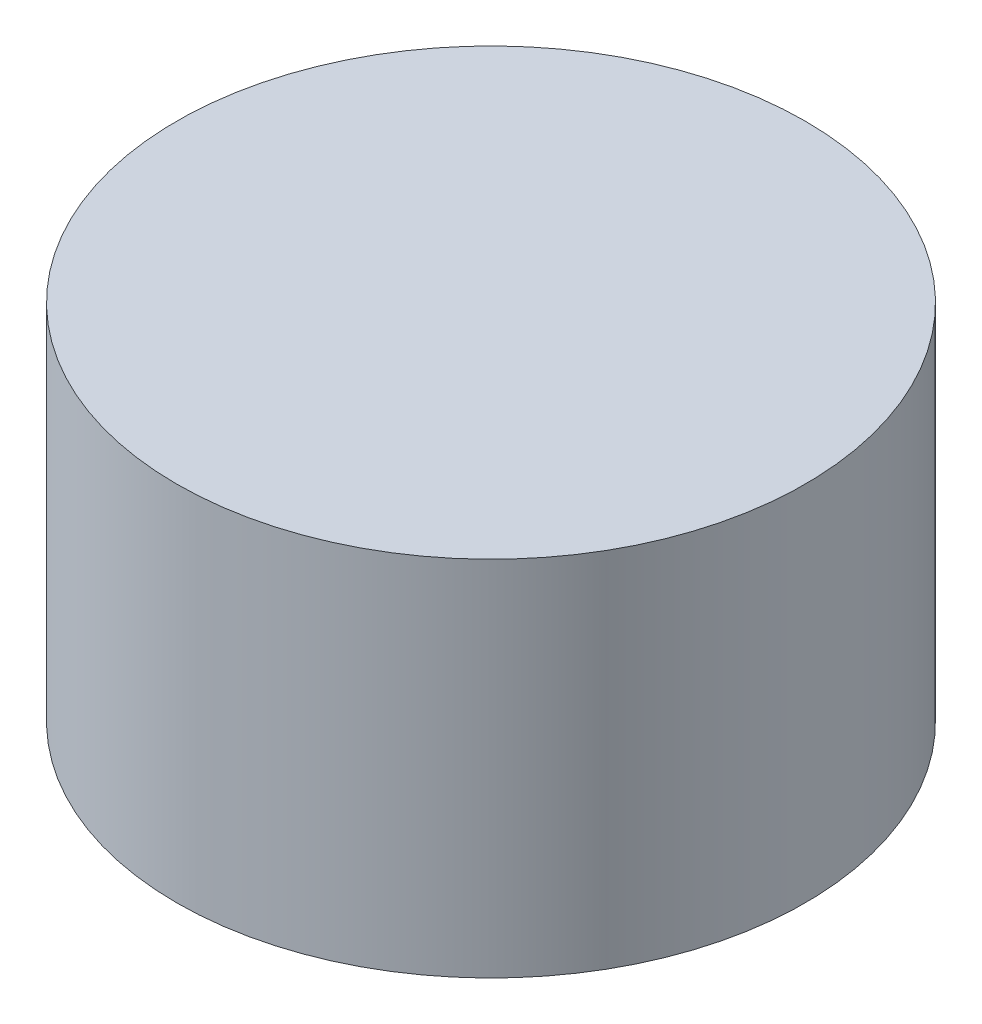
ISO-10303-21;
HEADER;
FILE_DESCRIPTION(('STEP AP214'),'2;1');
FILE_NAME('part.step','',(''),(''),'','','');
FILE_SCHEMA(('AUTOMOTIVE_DESIGN { 1 0 10303 214 1 1 1 1 }'));
ENDSEC;
DATA;
#1=APPLICATION_CONTEXT('core data for automotive mechanical design processes');
#2=APPLICATION_PROTOCOL_DEFINITION('international standard','automotive_design',2000,#1);
#3=PRODUCT_CONTEXT('',#1,'mechanical');
#4=PRODUCT('Part','Part','',(#3));
#5=PRODUCT_RELATED_PRODUCT_CATEGORY('part','',(#4));
#6=PRODUCT_DEFINITION_FORMATION('','',#4);
#7=PRODUCT_DEFINITION_CONTEXT('part definition',#1,'design');
#8=PRODUCT_DEFINITION('design','',#6,#7);
#9=PRODUCT_DEFINITION_SHAPE('','',#8);
#10=(LENGTH_UNIT() NAMED_UNIT(*) SI_UNIT(.MILLI.,.METRE.));
#11=(NAMED_UNIT(*) PLANE_ANGLE_UNIT() SI_UNIT($,.RADIAN.));
#12=(NAMED_UNIT(*) SI_UNIT($,.STERADIAN.) SOLID_ANGLE_UNIT());
#13=UNCERTAINTY_MEASURE_WITH_UNIT(LENGTH_MEASURE(1.E-05),#10,'distance_accuracy_value','');
#14=(GEOMETRIC_REPRESENTATION_CONTEXT(3) GLOBAL_UNCERTAINTY_ASSIGNED_CONTEXT((#13)) GLOBAL_UNIT_ASSIGNED_CONTEXT((#10,
#11,#12)) REPRESENTATION_CONTEXT('',''));
#15=CARTESIAN_POINT('',(0.,0.,0.));
#16=DIRECTION('',(0.,0.,1.));
#17=DIRECTION('',(1.,0.,0.));
#18=AXIS2_PLACEMENT_3D('',#15,#16,#17);
#19=CARTESIAN_POINT('',(0.,38.1,0.));
#20=DIRECTION('',(0.,-1.,0.));
#21=DIRECTION('',(0.,0.,-1.));
#22=AXIS2_PLACEMENT_3D('',#19,#20,#21);
#23=CYLINDRICAL_SURFACE('',#22,33.02);
#24=CARTESIAN_POINT('',(0.,38.1,0.));
#25=DIRECTION('',(0.,1.,0.));
#26=DIRECTION('',(0.,0.,1.));
#27=AXIS2_PLACEMENT_3D('',#24,#25,#26);
#28=CIRCLE('',#27,33.02);
#29=CARTESIAN_POINT('',(0.,38.1,33.02));
#30=VERTEX_POINT('',#29);
#31=EDGE_CURVE('E10',#30,#30,#28,.T.);
#32=ORIENTED_EDGE('',*,*,#31,.F.);
#33=EDGE_LOOP('',(#32));
#34=FACE_BOUND('',#33,.T.);
#35=CARTESIAN_POINT('',(0.,0.,0.));
#36=DIRECTION('',(0.,1.,0.));
#37=DIRECTION('',(0.,0.,1.));
#38=AXIS2_PLACEMENT_3D('',#35,#36,#37);
#39=CIRCLE('',#38,33.02);
#40=CARTESIAN_POINT('',(0.,0.,33.02));
#41=VERTEX_POINT('',#40);
#42=EDGE_CURVE('E35',#41,#41,#39,.T.);
#43=ORIENTED_EDGE('',*,*,#42,.T.);
#44=EDGE_LOOP('',(#43));
#45=FACE_BOUND('',#44,.T.);
#46=ADVANCED_FACE('F32',(#34,#45),#23,.T.);
#47=CARTESIAN_POINT('',(0.,38.1,0.));
#48=DIRECTION('',(0.,1.,0.));
#49=DIRECTION('',(0.,0.,1.));
#50=AXIS2_PLACEMENT_3D('',#47,#48,#49);
#51=PLANE('',#50);
#52=ORIENTED_EDGE('',*,*,#31,.T.);
#53=EDGE_LOOP('',(#52));
#54=FACE_BOUND('',#53,.T.);
#55=ADVANCED_FACE('F47',(#54),#51,.T.);
#56=CARTESIAN_POINT('',(0.,0.,0.));
#57=DIRECTION('',(0.,1.,0.));
#58=DIRECTION('',(0.,0.,1.));
#59=AXIS2_PLACEMENT_3D('',#56,#57,#58);
#60=PLANE('',#59);
#61=ORIENTED_EDGE('',*,*,#42,.F.);
#62=EDGE_LOOP('',(#61));
#63=FACE_BOUND('',#62,.T.);
#64=ADVANCED_FACE('F45',(#63),#60,.F.);
#65=CLOSED_SHELL('',(#46,#55,#64));
#66=MANIFOLD_SOLID_BREP('B2',#65);
#67=ADVANCED_BREP_SHAPE_REPRESENTATION('',(#18,#66),#14);
#68=SHAPE_DEFINITION_REPRESENTATION(#9,#67);
ENDSEC;
END-ISO-10303-21;
